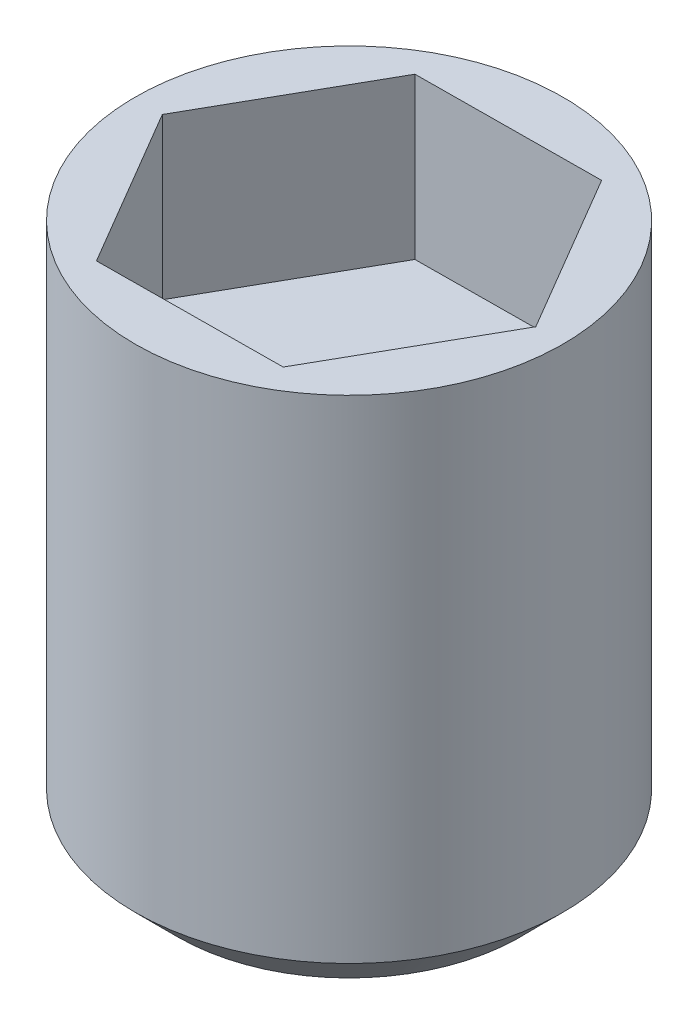
ISO-10303-21;
HEADER;
FILE_DESCRIPTION(('STEP AP214'),'2;1');
FILE_NAME('part.step','',(''),(''),'','','');
FILE_SCHEMA(('AUTOMOTIVE_DESIGN { 1 0 10303 214 1 1 1 1 }'));
ENDSEC;
DATA;
#1=APPLICATION_CONTEXT('core data for automotive mechanical design processes');
#2=APPLICATION_PROTOCOL_DEFINITION('international standard','automotive_design',2000,#1);
#3=PRODUCT_CONTEXT('',#1,'mechanical');
#4=PRODUCT('Part','Part','',(#3));
#5=PRODUCT_RELATED_PRODUCT_CATEGORY('part','',(#4));
#6=PRODUCT_DEFINITION_FORMATION('','',#4);
#7=PRODUCT_DEFINITION_CONTEXT('part definition',#1,'design');
#8=PRODUCT_DEFINITION('design','',#6,#7);
#9=PRODUCT_DEFINITION_SHAPE('','',#8);
#10=(LENGTH_UNIT() NAMED_UNIT(*) SI_UNIT(.MILLI.,.METRE.));
#11=(NAMED_UNIT(*) PLANE_ANGLE_UNIT() SI_UNIT($,.RADIAN.));
#12=(NAMED_UNIT(*) SI_UNIT($,.STERADIAN.) SOLID_ANGLE_UNIT());
#13=UNCERTAINTY_MEASURE_WITH_UNIT(LENGTH_MEASURE(1.E-05),#10,'distance_accuracy_value','');
#14=(GEOMETRIC_REPRESENTATION_CONTEXT(3) GLOBAL_UNCERTAINTY_ASSIGNED_CONTEXT((#13)) GLOBAL_UNIT_ASSIGNED_CONTEXT((#10,
#11,#12)) REPRESENTATION_CONTEXT('',''));
#15=CARTESIAN_POINT('',(0.,0.,0.));
#16=DIRECTION('',(0.,0.,1.));
#17=DIRECTION('',(1.,0.,0.));
#18=AXIS2_PLACEMENT_3D('',#15,#16,#17);
#19=CARTESIAN_POINT('',(0.,0.,0.));
#20=DIRECTION('',(0.,1.,0.));
#21=DIRECTION('',(0.,0.,1.));
#22=AXIS2_PLACEMENT_3D('',#19,#20,#21);
#23=PLANE('',#22);
#24=CARTESIAN_POINT('',(0.,0.,0.));
#25=DIRECTION('',(0.,1.,0.));
#26=DIRECTION('',(0.,0.,1.));
#27=AXIS2_PLACEMENT_3D('',#24,#25,#26);
#28=CIRCLE('',#27,3.2);
#29=CARTESIAN_POINT('',(0.,0.,3.2));
#30=VERTEX_POINT('',#29);
#31=EDGE_CURVE('E11',#30,#30,#28,.T.);
#32=ORIENTED_EDGE('',*,*,#31,.F.);
#33=EDGE_LOOP('',(#32));
#34=FACE_BOUND('',#33,.T.);
#35=ADVANCED_FACE('F35',(#34),#23,.F.);
#36=CARTESIAN_POINT('',(0.,0.,0.));
#37=DIRECTION('',(0.,1.,0.));
#38=DIRECTION('',(0.,0.,1.));
#39=AXIS2_PLACEMENT_3D('',#36,#37,#38);
#40=CONICAL_SURFACE('',#39,3.2,0.785398163397451);
#41=CARTESIAN_POINT('',(0.,0.799999999999995,0.));
#42=DIRECTION('',(0.,1.,0.));
#43=DIRECTION('',(0.,0.,1.));
#44=AXIS2_PLACEMENT_3D('',#41,#42,#43);
#45=CIRCLE('',#44,4.);
#46=CARTESIAN_POINT('',(0.,0.799999999999995,4.));
#47=VERTEX_POINT('',#46);
#48=EDGE_CURVE('E42',#47,#47,#45,.T.);
#49=ORIENTED_EDGE('',*,*,#48,.F.);
#50=EDGE_LOOP('',(#49));
#51=FACE_BOUND('',#50,.T.);
#52=ORIENTED_EDGE('',*,*,#31,.T.);
#53=EDGE_LOOP('',(#52));
#54=FACE_BOUND('',#53,.T.);
#55=ADVANCED_FACE('F148',(#51,#54),#40,.T.);
#56=CARTESIAN_POINT('',(0.,68.6445759886598,0.));
#57=DIRECTION('',(0.,1.,0.));
#58=DIRECTION('',(0.,0.,1.));
#59=AXIS2_PLACEMENT_3D('',#56,#57,#58);
#60=CYLINDRICAL_SURFACE('',#59,4.);
#61=CARTESIAN_POINT('',(0.,10.,0.));
#62=DIRECTION('',(0.,1.,0.));
#63=DIRECTION('',(0.,0.,1.));
#64=AXIS2_PLACEMENT_3D('',#61,#62,#63);
#65=CIRCLE('',#64,4.);
#66=CARTESIAN_POINT('',(0.,10.,4.));
#67=VERTEX_POINT('',#66);
#68=EDGE_CURVE('E136',#67,#67,#65,.T.);
#69=ORIENTED_EDGE('',*,*,#68,.F.);
#70=EDGE_LOOP('',(#69));
#71=FACE_BOUND('',#70,.T.);
#72=ORIENTED_EDGE('',*,*,#48,.T.);
#73=EDGE_LOOP('',(#72));
#74=FACE_BOUND('',#73,.T.);
#75=ADVANCED_FACE('F146',(#71,#74),#60,.T.);
#76=CARTESIAN_POINT('',(4.,10.,0.));
#77=DIRECTION('',(0.,-1.,0.));
#78=DIRECTION('',(0.,0.,-1.));
#79=AXIS2_PLACEMENT_3D('',#76,#77,#78);
#80=PLANE('',#79);
#81=DIRECTION('',(0.493268448593922,0.,-0.869877139383341));
#82=VECTOR('',#81,1.);
#83=CARTESIAN_POINT('',(1.75526540341467,10.,2.98647674753639));
#84=LINE('',#83,#82);
#85=CARTESIAN_POINT('',(1.75526540341467,10.,2.98647674753639));
#86=VERTEX_POINT('',#85);
#87=CARTESIAN_POINT('',(3.46399743288537,10.,-0.0268660559728551));
#88=VERTEX_POINT('',#87);
#89=EDGE_CURVE('E123',#86,#88,#84,.T.);
#90=ORIENTED_EDGE('',*,*,#89,.F.);
#91=DIRECTION('',(0.999969925174272,0.,-0.00775556232399564));
#92=VECTOR('',#91,1.);
#93=CARTESIAN_POINT('',(-1.7087320294707,10.,3.01334280350924));
#94=LINE('',#93,#92);
#95=CARTESIAN_POINT('',(-1.7087320294707,10.,3.01334280350924));
#96=VERTEX_POINT('',#95);
#97=EDGE_CURVE('E49',#96,#86,#94,.T.);
#98=ORIENTED_EDGE('',*,*,#97,.F.);
#99=DIRECTION('',(0.506701476580349,0.,0.862121577059346));
#100=VECTOR('',#99,1.);
#101=CARTESIAN_POINT('',(-3.46399743288537,10.,0.0268660559728533));
#102=LINE('',#101,#100);
#103=CARTESIAN_POINT('',(-3.46399743288537,10.,0.0268660559728533));
#104=VERTEX_POINT('',#103);
#105=EDGE_CURVE('E132',#104,#96,#102,.T.);
#106=ORIENTED_EDGE('',*,*,#105,.F.);
#107=DIRECTION('',(-0.493268448593922,0.,0.869877139383341));
#108=VECTOR('',#107,1.);
#109=CARTESIAN_POINT('',(-1.75526540341467,10.,-2.98647674753639));
#110=LINE('',#109,#108);
#111=CARTESIAN_POINT('',(-1.75526540341467,10.,-2.98647674753639));
#112=VERTEX_POINT('',#111);
#113=EDGE_CURVE('E130',#112,#104,#110,.T.);
#114=ORIENTED_EDGE('',*,*,#113,.F.);
#115=DIRECTION('',(-0.999969925174272,0.,0.0077555623239955));
#116=VECTOR('',#115,1.);
#117=CARTESIAN_POINT('',(1.7087320294707,10.,-3.01334280350924));
#118=LINE('',#117,#116);
#119=CARTESIAN_POINT('',(1.7087320294707,10.,-3.01334280350924));
#120=VERTEX_POINT('',#119);
#121=EDGE_CURVE('E97',#120,#112,#118,.T.);
#122=ORIENTED_EDGE('',*,*,#121,.F.);
#123=DIRECTION('',(-0.506701476580349,0.,-0.862121577059346));
#124=VECTOR('',#123,1.);
#125=CARTESIAN_POINT('',(3.46399743288537,10.,-0.0268660559728551));
#126=LINE('',#125,#124);
#127=EDGE_CURVE('E126',#88,#120,#126,.T.);
#128=ORIENTED_EDGE('',*,*,#127,.F.);
#129=EDGE_LOOP('',(#90,#98,#106,#114,#122,#128));
#130=FACE_BOUND('',#129,.T.);
#131=ORIENTED_EDGE('',*,*,#68,.T.);
#132=EDGE_LOOP('',(#131));
#133=FACE_BOUND('',#132,.T.);
#134=ADVANCED_FACE('F166',(#130,#133),#80,.F.);
#135=CARTESIAN_POINT('',(-1.7087320294707,7.,3.01334280350924));
#136=DIRECTION('',(0.00775556232399564,0.,0.999969925174272));
#137=DIRECTION('',(0.999969925174272,0.,-0.00775556232399564));
#138=AXIS2_PLACEMENT_3D('',#135,#136,#137);
#139=PLANE('',#138);
#140=ORIENTED_EDGE('',*,*,#97,.T.);
#141=DIRECTION('',(0.,1.,0.));
#142=VECTOR('',#141,1.);
#143=CARTESIAN_POINT('',(1.75526540341467,7.,2.98647674753639));
#144=LINE('',#143,#142);
#145=CARTESIAN_POINT('',(1.75526540341467,7.,2.98647674753639));
#146=VERTEX_POINT('',#145);
#147=EDGE_CURVE('E79',#146,#86,#144,.T.);
#148=ORIENTED_EDGE('',*,*,#147,.F.);
#149=DIRECTION('',(0.999969925174272,0.,-0.00775556232399564));
#150=VECTOR('',#149,1.);
#151=CARTESIAN_POINT('',(-1.7087320294707,7.,3.01334280350924));
#152=LINE('',#151,#150);
#153=CARTESIAN_POINT('',(-1.7087320294707,7.,3.01334280350924));
#154=VERTEX_POINT('',#153);
#155=EDGE_CURVE('E134',#154,#146,#152,.T.);
#156=ORIENTED_EDGE('',*,*,#155,.F.);
#157=DIRECTION('',(0.,1.,0.));
#158=VECTOR('',#157,1.);
#159=CARTESIAN_POINT('',(-1.7087320294707,7.,3.01334280350924));
#160=LINE('',#159,#158);
#161=EDGE_CURVE('E57',#154,#96,#160,.T.);
#162=ORIENTED_EDGE('',*,*,#161,.T.);
#163=EDGE_LOOP('',(#140,#148,#156,#162));
#164=FACE_BOUND('',#163,.T.);
#165=ADVANCED_FACE('F174',(#164),#139,.F.);
#166=CARTESIAN_POINT('',(-3.46399743288537,7.,0.0268660559728533));
#167=DIRECTION('',(-0.862121577059346,0.,0.506701476580349));
#168=DIRECTION('',(0.506701476580349,0.,0.862121577059346));
#169=AXIS2_PLACEMENT_3D('',#166,#167,#168);
#170=PLANE('',#169);
#171=ORIENTED_EDGE('',*,*,#105,.T.);
#172=ORIENTED_EDGE('',*,*,#161,.F.);
#173=DIRECTION('',(0.506701476580349,0.,0.862121577059346));
#174=VECTOR('',#173,1.);
#175=CARTESIAN_POINT('',(-3.46399743288537,7.,0.0268660559728533));
#176=LINE('',#175,#174);
#177=CARTESIAN_POINT('',(-3.46399743288537,7.,0.0268660559728533));
#178=VERTEX_POINT('',#177);
#179=EDGE_CURVE('E109',#178,#154,#176,.T.);
#180=ORIENTED_EDGE('',*,*,#179,.F.);
#181=DIRECTION('',(0.,1.,0.));
#182=VECTOR('',#181,1.);
#183=CARTESIAN_POINT('',(-3.46399743288537,7.,0.0268660559728533));
#184=LINE('',#183,#182);
#185=EDGE_CURVE('E101',#178,#104,#184,.T.);
#186=ORIENTED_EDGE('',*,*,#185,.T.);
#187=EDGE_LOOP('',(#171,#172,#180,#186));
#188=FACE_BOUND('',#187,.T.);
#189=ADVANCED_FACE('F182',(#188),#170,.F.);
#190=CARTESIAN_POINT('',(-1.75526540341467,7.,-2.98647674753639));
#191=DIRECTION('',(-0.869877139383341,0.,-0.493268448593922));
#192=DIRECTION('',(-0.493268448593922,0.,0.869877139383342));
#193=AXIS2_PLACEMENT_3D('',#190,#191,#192);
#194=PLANE('',#193);
#195=ORIENTED_EDGE('',*,*,#113,.T.);
#196=ORIENTED_EDGE('',*,*,#185,.F.);
#197=DIRECTION('',(-0.493268448593922,0.,0.869877139383341));
#198=VECTOR('',#197,1.);
#199=CARTESIAN_POINT('',(-1.75526540341467,7.,-2.98647674753639));
#200=LINE('',#199,#198);
#201=CARTESIAN_POINT('',(-1.75526540341467,7.,-2.98647674753639));
#202=VERTEX_POINT('',#201);
#203=EDGE_CURVE('E105',#202,#178,#200,.T.);
#204=ORIENTED_EDGE('',*,*,#203,.F.);
#205=DIRECTION('',(0.,1.,0.));
#206=VECTOR('',#205,1.);
#207=CARTESIAN_POINT('',(-1.75526540341467,7.,-2.98647674753639));
#208=LINE('',#207,#206);
#209=EDGE_CURVE('E90',#202,#112,#208,.T.);
#210=ORIENTED_EDGE('',*,*,#209,.T.);
#211=EDGE_LOOP('',(#195,#196,#204,#210));
#212=FACE_BOUND('',#211,.T.);
#213=ADVANCED_FACE('F106',(#212),#194,.F.);
#214=CARTESIAN_POINT('',(1.7087320294707,7.,-3.01334280350924));
#215=DIRECTION('',(-0.00775556232399551,0.,-0.999969925174272));
#216=DIRECTION('',(-0.999969925174272,0.,0.00775556232399551));
#217=AXIS2_PLACEMENT_3D('',#214,#215,#216);
#218=PLANE('',#217);
#219=ORIENTED_EDGE('',*,*,#121,.T.);
#220=ORIENTED_EDGE('',*,*,#209,.F.);
#221=DIRECTION('',(-0.999969925174272,0.,0.0077555623239955));
#222=VECTOR('',#221,1.);
#223=CARTESIAN_POINT('',(1.7087320294707,7.,-3.01334280350924));
#224=LINE('',#223,#222);
#225=CARTESIAN_POINT('',(1.7087320294707,7.,-3.01334280350924));
#226=VERTEX_POINT('',#225);
#227=EDGE_CURVE('E94',#226,#202,#224,.T.);
#228=ORIENTED_EDGE('',*,*,#227,.F.);
#229=DIRECTION('',(0.,1.,0.));
#230=VECTOR('',#229,1.);
#231=CARTESIAN_POINT('',(1.7087320294707,7.,-3.01334280350924));
#232=LINE('',#231,#230);
#233=EDGE_CURVE('E102',#226,#120,#232,.T.);
#234=ORIENTED_EDGE('',*,*,#233,.T.);
#235=EDGE_LOOP('',(#219,#220,#228,#234));
#236=FACE_BOUND('',#235,.T.);
#237=ADVANCED_FACE('F92',(#236),#218,.F.);
#238=CARTESIAN_POINT('',(3.46399743288537,7.,-0.0268660559728551));
#239=DIRECTION('',(0.862121577059346,0.,-0.50670147658035));
#240=DIRECTION('',(-0.50670147658035,0.,-0.862121577059346));
#241=AXIS2_PLACEMENT_3D('',#238,#239,#240);
#242=PLANE('',#241);
#243=ORIENTED_EDGE('',*,*,#127,.T.);
#244=ORIENTED_EDGE('',*,*,#233,.F.);
#245=DIRECTION('',(-0.506701476580349,0.,-0.862121577059346));
#246=VECTOR('',#245,1.);
#247=CARTESIAN_POINT('',(3.46399743288537,7.,-0.0268660559728551));
#248=LINE('',#247,#246);
#249=CARTESIAN_POINT('',(3.46399743288537,7.,-0.0268660559728551));
#250=VERTEX_POINT('',#249);
#251=EDGE_CURVE('E115',#250,#226,#248,.T.);
#252=ORIENTED_EDGE('',*,*,#251,.F.);
#253=DIRECTION('',(0.,1.,0.));
#254=VECTOR('',#253,1.);
#255=CARTESIAN_POINT('',(3.46399743288537,7.,-0.0268660559728551));
#256=LINE('',#255,#254);
#257=EDGE_CURVE('E139',#250,#88,#256,.T.);
#258=ORIENTED_EDGE('',*,*,#257,.T.);
#259=EDGE_LOOP('',(#243,#244,#252,#258));
#260=FACE_BOUND('',#259,.T.);
#261=ADVANCED_FACE('F201',(#260),#242,.F.);
#262=CARTESIAN_POINT('',(1.75526540341467,7.,2.98647674753639));
#263=DIRECTION('',(0.869877139383341,0.,0.493268448593922));
#264=DIRECTION('',(0.493268448593922,0.,-0.869877139383342));
#265=AXIS2_PLACEMENT_3D('',#262,#263,#264);
#266=PLANE('',#265);
#267=ORIENTED_EDGE('',*,*,#89,.T.);
#268=ORIENTED_EDGE('',*,*,#257,.F.);
#269=DIRECTION('',(0.493268448593922,0.,-0.869877139383341));
#270=VECTOR('',#269,1.);
#271=CARTESIAN_POINT('',(1.75526540341467,7.,2.98647674753639));
#272=LINE('',#271,#270);
#273=EDGE_CURVE('E117',#146,#250,#272,.T.);
#274=ORIENTED_EDGE('',*,*,#273,.F.);
#275=ORIENTED_EDGE('',*,*,#147,.T.);
#276=EDGE_LOOP('',(#267,#268,#274,#275));
#277=FACE_BOUND('',#276,.T.);
#278=ADVANCED_FACE('F208',(#277),#266,.F.);
#279=CARTESIAN_POINT('',(0.,7.,0.));
#280=DIRECTION('',(0.,1.,0.));
#281=DIRECTION('',(0.,0.,1.));
#282=AXIS2_PLACEMENT_3D('',#279,#280,#281);
#283=PLANE('',#282);
#284=ORIENTED_EDGE('',*,*,#155,.T.);
#285=ORIENTED_EDGE('',*,*,#273,.T.);
#286=ORIENTED_EDGE('',*,*,#251,.T.);
#287=ORIENTED_EDGE('',*,*,#227,.T.);
#288=ORIENTED_EDGE('',*,*,#203,.T.);
#289=ORIENTED_EDGE('',*,*,#179,.T.);
#290=EDGE_LOOP('',(#284,#285,#286,#287,#288,#289));
#291=FACE_BOUND('',#290,.T.);
#292=ADVANCED_FACE('F112',(#291),#283,.T.);
#293=CLOSED_SHELL('',(#35,#55,#75,#134,#165,#189,#213,#237,#261,#278,#292));
#294=MANIFOLD_SOLID_BREP('B2',#293);
#295=ADVANCED_BREP_SHAPE_REPRESENTATION('',(#18,#294),#14);
#296=SHAPE_DEFINITION_REPRESENTATION(#9,#295);
ENDSEC;
END-ISO-10303-21;
